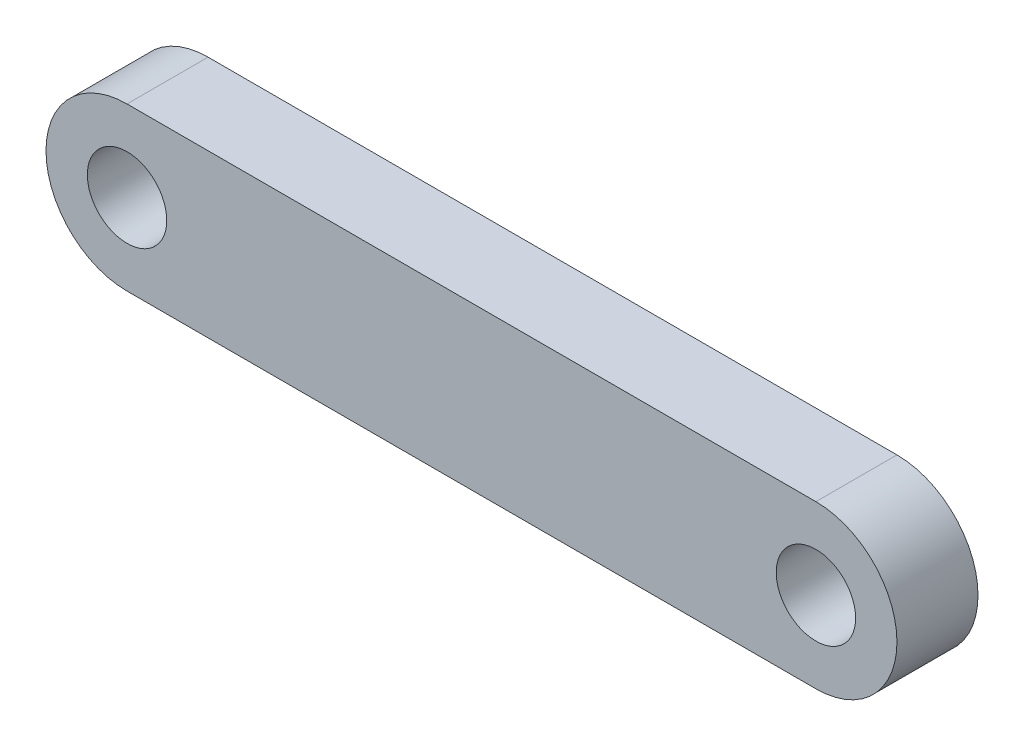
ISO-10303-21;
HEADER;
FILE_DESCRIPTION(('STEP AP214'),'2;1');
FILE_NAME('part.step','',(''),(''),'','','');
FILE_SCHEMA(('AUTOMOTIVE_DESIGN { 1 0 10303 214 1 1 1 1 }'));
ENDSEC;
DATA;
#1=APPLICATION_CONTEXT('core data for automotive mechanical design processes');
#2=APPLICATION_PROTOCOL_DEFINITION('international standard','automotive_design',2000,#1);
#3=PRODUCT_CONTEXT('',#1,'mechanical');
#4=PRODUCT('Part','Part','',(#3));
#5=PRODUCT_RELATED_PRODUCT_CATEGORY('part','',(#4));
#6=PRODUCT_DEFINITION_FORMATION('','',#4);
#7=PRODUCT_DEFINITION_CONTEXT('part definition',#1,'design');
#8=PRODUCT_DEFINITION('design','',#6,#7);
#9=PRODUCT_DEFINITION_SHAPE('','',#8);
#10=(LENGTH_UNIT() NAMED_UNIT(*) SI_UNIT(.MILLI.,.METRE.));
#11=(NAMED_UNIT(*) PLANE_ANGLE_UNIT() SI_UNIT($,.RADIAN.));
#12=(NAMED_UNIT(*) SI_UNIT($,.STERADIAN.) SOLID_ANGLE_UNIT());
#13=UNCERTAINTY_MEASURE_WITH_UNIT(LENGTH_MEASURE(1.E-05),#10,'distance_accuracy_value','');
#14=(GEOMETRIC_REPRESENTATION_CONTEXT(3) GLOBAL_UNCERTAINTY_ASSIGNED_CONTEXT((#13)) GLOBAL_UNIT_ASSIGNED_CONTEXT((#10,
#11,#12)) REPRESENTATION_CONTEXT('',''));
#15=CARTESIAN_POINT('',(0.,0.,0.));
#16=DIRECTION('',(0.,0.,1.));
#17=DIRECTION('',(1.,0.,0.));
#18=AXIS2_PLACEMENT_3D('',#15,#16,#17);
#19=CARTESIAN_POINT('',(-26.9875,0.,3.175));
#20=DIRECTION('',(0.,0.,1.));
#21=DIRECTION('',(1.,0.,0.));
#22=AXIS2_PLACEMENT_3D('',#19,#20,#21);
#23=PLANE('',#22);
#24=CARTESIAN_POINT('',(-26.9875,0.,3.175));
#25=DIRECTION('',(0.,0.,1.));
#26=DIRECTION('',(1.,0.,0.));
#27=AXIS2_PLACEMENT_3D('',#24,#25,#26);
#28=CIRCLE('',#27,3.1115);
#29=CARTESIAN_POINT('',(-23.876,0.,3.175));
#30=VERTEX_POINT('',#29);
#31=EDGE_CURVE('E103',#30,#30,#28,.T.);
#32=ORIENTED_EDGE('',*,*,#31,.F.);
#33=EDGE_LOOP('',(#32));
#34=FACE_BOUND('',#33,.T.);
#35=CARTESIAN_POINT('',(-26.9875,0.,3.175));
#36=DIRECTION('',(0.,0.,1.));
#37=DIRECTION('',(1.,0.,0.));
#38=AXIS2_PLACEMENT_3D('',#35,#36,#37);
#39=CIRCLE('',#38,6.35);
#40=CARTESIAN_POINT('',(-26.9875,6.35,3.175));
#41=VERTEX_POINT('',#40);
#42=CARTESIAN_POINT('',(-26.9875,-6.35,3.175));
#43=VERTEX_POINT('',#42);
#44=EDGE_CURVE('E88',#41,#43,#39,.T.);
#45=ORIENTED_EDGE('',*,*,#44,.T.);
#46=DIRECTION('',(1.,0.,0.));
#47=VECTOR('',#46,1.);
#48=CARTESIAN_POINT('',(-26.9875,-6.35,3.175));
#49=LINE('',#48,#47);
#50=CARTESIAN_POINT('',(26.9875,-6.34999999999999,3.175));
#51=VERTEX_POINT('',#50);
#52=EDGE_CURVE('E83',#43,#51,#49,.T.);
#53=ORIENTED_EDGE('',*,*,#52,.T.);
#54=CARTESIAN_POINT('',(26.9875,0.,3.175));
#55=DIRECTION('',(0.,0.,1.));
#56=DIRECTION('',(1.,0.,0.));
#57=AXIS2_PLACEMENT_3D('',#54,#55,#56);
#58=CIRCLE('',#57,6.35);
#59=CARTESIAN_POINT('',(26.9875,6.35000000000001,3.175));
#60=VERTEX_POINT('',#59);
#61=EDGE_CURVE('E86',#51,#60,#58,.T.);
#62=ORIENTED_EDGE('',*,*,#61,.T.);
#63=DIRECTION('',(-1.,0.,0.));
#64=VECTOR('',#63,1.);
#65=CARTESIAN_POINT('',(-26.9875,6.35,3.175));
#66=LINE('',#65,#64);
#67=EDGE_CURVE('E53',#60,#41,#66,.T.);
#68=ORIENTED_EDGE('',*,*,#67,.T.);
#69=EDGE_LOOP('',(#45,#53,#62,#68));
#70=FACE_BOUND('',#69,.T.);
#71=CARTESIAN_POINT('',(26.9875,0.,3.175));
#72=DIRECTION('',(0.,0.,1.));
#73=DIRECTION('',(1.,0.,0.));
#74=AXIS2_PLACEMENT_3D('',#71,#72,#73);
#75=CIRCLE('',#74,3.1115);
#76=CARTESIAN_POINT('',(30.099,0.,3.175));
#77=VERTEX_POINT('',#76);
#78=EDGE_CURVE('E118',#77,#77,#75,.T.);
#79=ORIENTED_EDGE('',*,*,#78,.F.);
#80=EDGE_LOOP('',(#79));
#81=FACE_BOUND('',#80,.T.);
#82=ADVANCED_FACE('F36',(#34,#70,#81),#23,.T.);
#83=CARTESIAN_POINT('',(-26.9875,0.,-3.175));
#84=DIRECTION('',(0.,0.,1.));
#85=DIRECTION('',(1.,0.,0.));
#86=AXIS2_PLACEMENT_3D('',#83,#84,#85);
#87=PLANE('',#86);
#88=CARTESIAN_POINT('',(-26.9875,0.,-3.175));
#89=DIRECTION('',(0.,0.,1.));
#90=DIRECTION('',(1.,0.,0.));
#91=AXIS2_PLACEMENT_3D('',#88,#89,#90);
#92=CIRCLE('',#91,6.35);
#93=CARTESIAN_POINT('',(-26.9875,6.35,-3.175));
#94=VERTEX_POINT('',#93);
#95=CARTESIAN_POINT('',(-26.9875,-6.35,-3.175));
#96=VERTEX_POINT('',#95);
#97=EDGE_CURVE('E100',#94,#96,#92,.T.);
#98=ORIENTED_EDGE('',*,*,#97,.F.);
#99=DIRECTION('',(-1.,0.,0.));
#100=VECTOR('',#99,1.);
#101=CARTESIAN_POINT('',(-26.9875,6.35,-3.175));
#102=LINE('',#101,#100);
#103=CARTESIAN_POINT('',(26.9875,6.35000000000001,-3.175));
#104=VERTEX_POINT('',#103);
#105=EDGE_CURVE('E76',#104,#94,#102,.T.);
#106=ORIENTED_EDGE('',*,*,#105,.F.);
#107=CARTESIAN_POINT('',(26.9875,0.,-3.175));
#108=DIRECTION('',(0.,0.,1.));
#109=DIRECTION('',(1.,0.,0.));
#110=AXIS2_PLACEMENT_3D('',#107,#108,#109);
#111=CIRCLE('',#110,6.35);
#112=CARTESIAN_POINT('',(26.9875,-6.34999999999999,-3.175));
#113=VERTEX_POINT('',#112);
#114=EDGE_CURVE('E70',#113,#104,#111,.T.);
#115=ORIENTED_EDGE('',*,*,#114,.F.);
#116=DIRECTION('',(1.,0.,0.));
#117=VECTOR('',#116,1.);
#118=CARTESIAN_POINT('',(-26.9875,-6.35,-3.175));
#119=LINE('',#118,#117);
#120=EDGE_CURVE('E92',#96,#113,#119,.T.);
#121=ORIENTED_EDGE('',*,*,#120,.F.);
#122=EDGE_LOOP('',(#98,#106,#115,#121));
#123=FACE_BOUND('',#122,.T.);
#124=CARTESIAN_POINT('',(-26.9875,0.,-3.175));
#125=DIRECTION('',(0.,0.,1.));
#126=DIRECTION('',(1.,0.,0.));
#127=AXIS2_PLACEMENT_3D('',#124,#125,#126);
#128=CIRCLE('',#127,3.1115);
#129=CARTESIAN_POINT('',(-23.876,0.,-3.175));
#130=VERTEX_POINT('',#129);
#131=EDGE_CURVE('E115',#130,#130,#128,.T.);
#132=ORIENTED_EDGE('',*,*,#131,.T.);
#133=EDGE_LOOP('',(#132));
#134=FACE_BOUND('',#133,.T.);
#135=CARTESIAN_POINT('',(26.9875,0.,-3.175));
#136=DIRECTION('',(0.,0.,1.));
#137=DIRECTION('',(1.,0.,0.));
#138=AXIS2_PLACEMENT_3D('',#135,#136,#137);
#139=CIRCLE('',#138,3.1115);
#140=CARTESIAN_POINT('',(30.099,0.,-3.175));
#141=VERTEX_POINT('',#140);
#142=EDGE_CURVE('E121',#141,#141,#139,.T.);
#143=ORIENTED_EDGE('',*,*,#142,.T.);
#144=EDGE_LOOP('',(#143));
#145=FACE_BOUND('',#144,.T.);
#146=ADVANCED_FACE('F111',(#123,#134,#145),#87,.F.);
#147=CARTESIAN_POINT('',(-26.9875,0.,3.175));
#148=DIRECTION('',(0.,0.,-1.));
#149=DIRECTION('',(-1.,0.,0.));
#150=AXIS2_PLACEMENT_3D('',#147,#148,#149);
#151=CYLINDRICAL_SURFACE('',#150,6.35);
#152=ORIENTED_EDGE('',*,*,#97,.T.);
#153=DIRECTION('',(0.,0.,-1.));
#154=VECTOR('',#153,1.);
#155=CARTESIAN_POINT('',(-26.9875,-6.35,3.175));
#156=LINE('',#155,#154);
#157=EDGE_CURVE('E11',#43,#96,#156,.T.);
#158=ORIENTED_EDGE('',*,*,#157,.F.);
#159=ORIENTED_EDGE('',*,*,#44,.F.);
#160=DIRECTION('',(0.,0.,-1.));
#161=VECTOR('',#160,1.);
#162=CARTESIAN_POINT('',(-26.9875,6.35,3.175));
#163=LINE('',#162,#161);
#164=EDGE_CURVE('E96',#41,#94,#163,.T.);
#165=ORIENTED_EDGE('',*,*,#164,.T.);
#166=EDGE_LOOP('',(#152,#158,#159,#165));
#167=FACE_BOUND('',#166,.T.);
#168=ADVANCED_FACE('F38',(#167),#151,.T.);
#169=CARTESIAN_POINT('',(-26.9875,-6.35,3.175));
#170=DIRECTION('',(0.,1.,0.));
#171=DIRECTION('',(-1.,0.,0.));
#172=AXIS2_PLACEMENT_3D('',#169,#170,#171);
#173=PLANE('',#172);
#174=ORIENTED_EDGE('',*,*,#120,.T.);
#175=DIRECTION('',(0.,0.,-1.));
#176=VECTOR('',#175,1.);
#177=CARTESIAN_POINT('',(26.9875,-6.34999999999999,3.175));
#178=LINE('',#177,#176);
#179=EDGE_CURVE('E45',#51,#113,#178,.T.);
#180=ORIENTED_EDGE('',*,*,#179,.F.);
#181=ORIENTED_EDGE('',*,*,#52,.F.);
#182=ORIENTED_EDGE('',*,*,#157,.T.);
#183=EDGE_LOOP('',(#174,#180,#181,#182));
#184=FACE_BOUND('',#183,.T.);
#185=ADVANCED_FACE('F91',(#184),#173,.F.);
#186=CARTESIAN_POINT('',(26.9875,0.,3.175));
#187=DIRECTION('',(0.,0.,-1.));
#188=DIRECTION('',(-1.,0.,0.));
#189=AXIS2_PLACEMENT_3D('',#186,#187,#188);
#190=CYLINDRICAL_SURFACE('',#189,6.35);
#191=ORIENTED_EDGE('',*,*,#114,.T.);
#192=DIRECTION('',(0.,0.,-1.));
#193=VECTOR('',#192,1.);
#194=CARTESIAN_POINT('',(26.9875,6.35000000000001,3.175));
#195=LINE('',#194,#193);
#196=EDGE_CURVE('E93',#60,#104,#195,.T.);
#197=ORIENTED_EDGE('',*,*,#196,.F.);
#198=ORIENTED_EDGE('',*,*,#61,.F.);
#199=ORIENTED_EDGE('',*,*,#179,.T.);
#200=EDGE_LOOP('',(#191,#197,#198,#199));
#201=FACE_BOUND('',#200,.T.);
#202=ADVANCED_FACE('F94',(#201),#190,.T.);
#203=CARTESIAN_POINT('',(-26.9875,6.35,3.175));
#204=DIRECTION('',(0.,-1.,0.));
#205=DIRECTION('',(1.,0.,0.));
#206=AXIS2_PLACEMENT_3D('',#203,#204,#205);
#207=PLANE('',#206);
#208=ORIENTED_EDGE('',*,*,#105,.T.);
#209=ORIENTED_EDGE('',*,*,#164,.F.);
#210=ORIENTED_EDGE('',*,*,#67,.F.);
#211=ORIENTED_EDGE('',*,*,#196,.T.);
#212=EDGE_LOOP('',(#208,#209,#210,#211));
#213=FACE_BOUND('',#212,.T.);
#214=ADVANCED_FACE('F108',(#213),#207,.F.);
#215=CARTESIAN_POINT('',(-26.9875,0.,3.175));
#216=DIRECTION('',(0.,0.,-1.));
#217=DIRECTION('',(-1.,0.,0.));
#218=AXIS2_PLACEMENT_3D('',#215,#216,#217);
#219=CYLINDRICAL_SURFACE('',#218,3.1115);
#220=ORIENTED_EDGE('',*,*,#31,.T.);
#221=EDGE_LOOP('',(#220));
#222=FACE_BOUND('',#221,.T.);
#223=ORIENTED_EDGE('',*,*,#131,.F.);
#224=EDGE_LOOP('',(#223));
#225=FACE_BOUND('',#224,.T.);
#226=ADVANCED_FACE('F138',(#222,#225),#219,.F.);
#227=CARTESIAN_POINT('',(26.9875,0.,3.175));
#228=DIRECTION('',(0.,0.,-1.));
#229=DIRECTION('',(-1.,0.,0.));
#230=AXIS2_PLACEMENT_3D('',#227,#228,#229);
#231=CYLINDRICAL_SURFACE('',#230,3.1115);
#232=ORIENTED_EDGE('',*,*,#78,.T.);
#233=EDGE_LOOP('',(#232));
#234=FACE_BOUND('',#233,.T.);
#235=ORIENTED_EDGE('',*,*,#142,.F.);
#236=EDGE_LOOP('',(#235));
#237=FACE_BOUND('',#236,.T.);
#238=ADVANCED_FACE('F127',(#234,#237),#231,.F.);
#239=CLOSED_SHELL('',(#82,#146,#168,#185,#202,#214,#226,#238));
#240=MANIFOLD_SOLID_BREP('B2',#239);
#241=ADVANCED_BREP_SHAPE_REPRESENTATION('',(#18,#240),#14);
#242=SHAPE_DEFINITION_REPRESENTATION(#9,#241);
ENDSEC;
END-ISO-10303-21;
